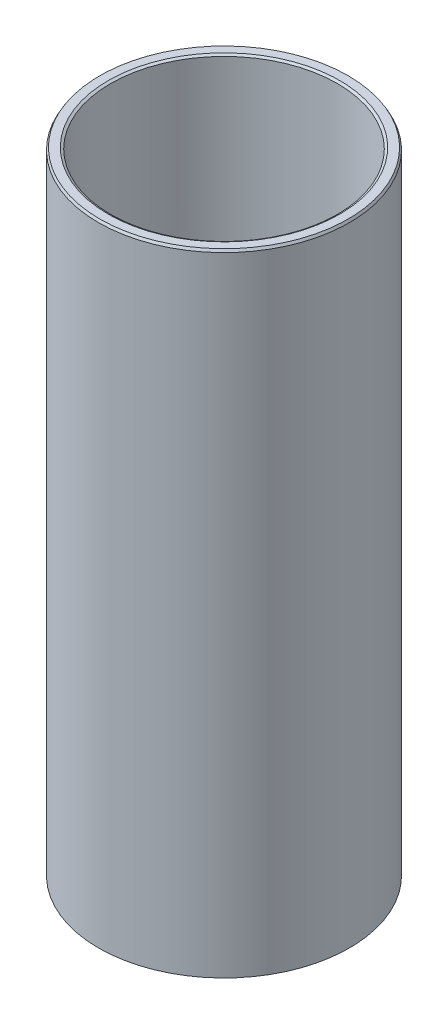
ISO-10303-21;
HEADER;
FILE_DESCRIPTION(('STEP AP214'),'2;1');
FILE_NAME('part.step','',(''),(''),'','','');
FILE_SCHEMA(('AUTOMOTIVE_DESIGN { 1 0 10303 214 1 1 1 1 }'));
ENDSEC;
DATA;
#1=APPLICATION_CONTEXT('core data for automotive mechanical design processes');
#2=APPLICATION_PROTOCOL_DEFINITION('international standard','automotive_design',2000,#1);
#3=PRODUCT_CONTEXT('',#1,'mechanical');
#4=PRODUCT('Part','Part','',(#3));
#5=PRODUCT_RELATED_PRODUCT_CATEGORY('part','',(#4));
#6=PRODUCT_DEFINITION_FORMATION('','',#4);
#7=PRODUCT_DEFINITION_CONTEXT('part definition',#1,'design');
#8=PRODUCT_DEFINITION('design','',#6,#7);
#9=PRODUCT_DEFINITION_SHAPE('','',#8);
#10=(LENGTH_UNIT() NAMED_UNIT(*) SI_UNIT(.MILLI.,.METRE.));
#11=(NAMED_UNIT(*) PLANE_ANGLE_UNIT() SI_UNIT($,.RADIAN.));
#12=(NAMED_UNIT(*) SI_UNIT($,.STERADIAN.) SOLID_ANGLE_UNIT());
#13=UNCERTAINTY_MEASURE_WITH_UNIT(LENGTH_MEASURE(1.E-05),#10,'distance_accuracy_value','');
#14=(GEOMETRIC_REPRESENTATION_CONTEXT(3) GLOBAL_UNCERTAINTY_ASSIGNED_CONTEXT((#13)) GLOBAL_UNIT_ASSIGNED_CONTEXT((#10,
#11,#12)) REPRESENTATION_CONTEXT('',''));
#15=CARTESIAN_POINT('',(0.,0.,0.));
#16=DIRECTION('',(0.,0.,1.));
#17=DIRECTION('',(1.,0.,0.));
#18=AXIS2_PLACEMENT_3D('',#15,#16,#17);
#19=CARTESIAN_POINT('',(0.,276.860027287661,0.));
#20=DIRECTION('',(0.,-1.,0.));
#21=DIRECTION('',(0.,0.,-1.));
#22=AXIS2_PLACEMENT_3D('',#19,#20,#21);
#23=CYLINDRICAL_SURFACE('',#22,55.);
#24=CARTESIAN_POINT('',(0.,0.606831183895817,0.));
#25=DIRECTION('',(0.,1.,0.));
#26=DIRECTION('',(0.,0.,1.));
#27=AXIS2_PLACEMENT_3D('',#24,#25,#26);
#28=CIRCLE('',#27,55.);
#29=CARTESIAN_POINT('',(0.,0.606831183895762,-55.));
#30=VERTEX_POINT('',#29);
#31=EDGE_CURVE('E10',#30,#30,#28,.T.);
#32=CARTESIAN_POINT('',(0.,275.808964845537,0.));
#33=DIRECTION('',(0.,1.,0.));
#34=DIRECTION('',(0.,0.,1.));
#35=AXIS2_PLACEMENT_3D('',#32,#33,#34);
#36=CIRCLE('',#35,55.);
#37=CARTESIAN_POINT('',(0.,275.808964845537,-55.));
#38=VERTEX_POINT('',#37);
#39=EDGE_CURVE('E50',#38,#38,#36,.F.);
#40=CARTESIAN_POINT('',(0.,0.606831183895762,-55.));
#41=CARTESIAN_POINT('',(0.,3.47352007620453,-55.));
#42=CARTESIAN_POINT('',(0.,6.3402089685133,-55.));
#43=CARTESIAN_POINT('',(0.,12.0735867531308,-55.));
#44=CARTESIAN_POINT('',(0.,14.9402756454396,-55.));
#45=CARTESIAN_POINT('',(0.,20.6736534300571,-55.));
#46=CARTESIAN_POINT('',(0.,23.5403423223659,-55.));
#47=CARTESIAN_POINT('',(0.,29.2737201069834,-55.));
#48=CARTESIAN_POINT('',(0.,32.1404089992921,-55.));
#49=CARTESIAN_POINT('',(0.,37.8737867839097,-55.));
#50=CARTESIAN_POINT('',(0.,40.7404756762184,-55.));
#51=CARTESIAN_POINT('',(0.,46.4738534608359,-55.));
#52=CARTESIAN_POINT('',(0.,49.3405423531447,-55.));
#53=CARTESIAN_POINT('',(0.,55.0739201377622,-55.));
#54=CARTESIAN_POINT('',(0.,57.940609030071,-55.));
#55=CARTESIAN_POINT('',(0.,63.6739868146885,-55.));
#56=CARTESIAN_POINT('',(0.,66.5406757069973,-55.));
#57=CARTESIAN_POINT('',(0.,72.2740534916148,-55.));
#58=CARTESIAN_POINT('',(0.,75.1407423839236,-55.));
#59=CARTESIAN_POINT('',(0.,80.8741201685411,-55.));
#60=CARTESIAN_POINT('',(0.,83.7408090608499,-55.));
#61=CARTESIAN_POINT('',(0.,89.4741868454674,-55.));
#62=CARTESIAN_POINT('',(0.,92.3408757377762,-55.));
#63=CARTESIAN_POINT('',(0.,98.0742535223937,-55.));
#64=CARTESIAN_POINT('',(0.,100.940942414702,-55.));
#65=CARTESIAN_POINT('',(0.,106.67432019932,-55.));
#66=CARTESIAN_POINT('',(0.,109.541009091629,-55.));
#67=CARTESIAN_POINT('',(0.,115.274386876246,-55.));
#68=CARTESIAN_POINT('',(0.,118.141075768555,-55.));
#69=CARTESIAN_POINT('',(0.,123.874453553173,-55.));
#70=CARTESIAN_POINT('',(0.,126.741142445481,-55.));
#71=CARTESIAN_POINT('',(0.,132.474520230099,-55.));
#72=CARTESIAN_POINT('',(0.,135.341209122408,-55.));
#73=CARTESIAN_POINT('',(0.,141.074586907025,-55.));
#74=CARTESIAN_POINT('',(0.,143.941275799334,-55.));
#75=CARTESIAN_POINT('',(0.,149.674653583951,-55.));
#76=CARTESIAN_POINT('',(0.,152.54134247626,-55.));
#77=CARTESIAN_POINT('',(0.,158.274720260878,-55.));
#78=CARTESIAN_POINT('',(0.,161.141409153187,-55.));
#79=CARTESIAN_POINT('',(0.,166.874786937804,-55.));
#80=CARTESIAN_POINT('',(0.,169.741475830113,-55.));
#81=CARTESIAN_POINT('',(0.,175.47485361473,-55.));
#82=CARTESIAN_POINT('',(0.,178.341542507039,-55.));
#83=CARTESIAN_POINT('',(0.,184.074920291657,-55.));
#84=CARTESIAN_POINT('',(0.,186.941609183965,-55.));
#85=CARTESIAN_POINT('',(0.,192.674986968583,-55.));
#86=CARTESIAN_POINT('',(0.,195.541675860892,-55.));
#87=CARTESIAN_POINT('',(0.,201.275053645509,-55.));
#88=CARTESIAN_POINT('',(0.,204.141742537818,-55.));
#89=CARTESIAN_POINT('',(0.,209.875120322435,-55.));
#90=CARTESIAN_POINT('',(0.,212.741809214744,-55.));
#91=CARTESIAN_POINT('',(0.,218.475186999362,-55.));
#92=CARTESIAN_POINT('',(0.,221.34187589167,-55.));
#93=CARTESIAN_POINT('',(0.,227.075253676288,-55.));
#94=CARTESIAN_POINT('',(0.,229.941942568597,-55.));
#95=CARTESIAN_POINT('',(0.,235.675320353214,-55.));
#96=CARTESIAN_POINT('',(0.,238.542009245523,-55.));
#97=CARTESIAN_POINT('',(0.,244.275387030141,-55.));
#98=CARTESIAN_POINT('',(0.,247.142075922449,-55.));
#99=CARTESIAN_POINT('',(0.,252.875453707067,-55.));
#100=CARTESIAN_POINT('',(0.,255.742142599376,-55.));
#101=CARTESIAN_POINT('',(0.,261.475520383993,-55.));
#102=CARTESIAN_POINT('',(0.,264.342209276302,-55.));
#103=CARTESIAN_POINT('',(0.,270.075587060919,-55.));
#104=CARTESIAN_POINT('',(0.,272.942275953228,-55.));
#105=CARTESIAN_POINT('',(0.,275.808964845537,-55.));
#106=B_SPLINE_CURVE_WITH_KNOTS('',3,(#40,#41,#42,#43,#44,#45,#46,#47,#48,#49,#50,#51,#52,#53,
#54,#55,#56,#57,#58,#59,#60,#61,#62,#63,#64,#65,#66,#67,#68,#69,#70,#71,#72,#73,#74,#75,#76,#77,
#78,#79,#80,#81,#82,#83,#84,#85,#86,#87,#88,#89,#90,#91,#92,#93,#94,#95,#96,#97,#98,#99,#100,
#101,#102,#103,#104,#105),.UNSPECIFIED.,.F.,.F.,(4,2,2,2,2,2,2,2,2,2,2,2,2,2,2,2,2,2,2,2,2,2,2,
2,2,2,2,2,2,2,2,2,4),(0.,8.60006667692631,17.2001333538526,25.8002000307789,34.4002667077051,
43.0003333846314,51.6004000615577,60.200466738484,68.8005334154103,77.4006000923366,
86.0006667692629,94.6007334461892,103.200800123115,111.800866800042,120.400933476968,
129.001000153894,137.601066830821,146.201133507747,154.801200184673,163.4012668616,
172.001333538526,180.601400215452,189.201466892378,197.801533569305,206.401600246231,
215.001666923157,223.601733600084,232.20180027701,240.801866953936,249.401933630862,
258.002000307789,266.602066984715,275.202133661641),.UNSPECIFIED.);
#107=EDGE_CURVE('BSEAM39',#30,#38,#106,.T.);
#108=ORIENTED_EDGE('',*,*,#31,.T.);
#109=ORIENTED_EDGE('',*,*,#39,.T.);
#110=ORIENTED_EDGE('',*,*,#107,.T.);
#111=ORIENTED_EDGE('',*,*,#107,.F.);
#112=EDGE_LOOP('',(#108,#110,#109,#111));
#113=FACE_BOUND('',#112,.T.);
#114=ADVANCED_FACE('F39',(#113),#23,.T.);
#115=CARTESIAN_POINT('',(0.,276.860027287661,0.));
#116=DIRECTION('',(0.,1.,0.));
#117=DIRECTION('',(0.,0.,1.));
#118=AXIS2_PLACEMENT_3D('',#115,#116,#117);
#119=PLANE('',#118);
#120=CARTESIAN_POINT('',(0.,276.860027287661,0.));
#121=DIRECTION('',(0.,1.,0.));
#122=DIRECTION('',(0.,0.,1.));
#123=AXIS2_PLACEMENT_3D('',#120,#121,#122);
#124=CIRCLE('',#123,50.7158337583343);
#125=CARTESIAN_POINT('',(0.,276.860027287661,50.7158337583343));
#126=VERTEX_POINT('',#125);
#127=EDGE_CURVE('E58',#126,#126,#124,.F.);
#128=ORIENTED_EDGE('',*,*,#127,.T.);
#129=EDGE_LOOP('',(#128));
#130=FACE_BOUND('',#129,.T.);
#131=CARTESIAN_POINT('',(0.,276.860027287661,0.));
#132=DIRECTION('',(0.,1.,0.));
#133=DIRECTION('',(0.,0.,1.));
#134=AXIS2_PLACEMENT_3D('',#131,#132,#133);
#135=CIRCLE('',#134,54.3931688161045);
#136=CARTESIAN_POINT('',(0.,276.860027287661,54.3931688161045));
#137=VERTEX_POINT('',#136);
#138=EDGE_CURVE('E61',#137,#137,#135,.T.);
#139=ORIENTED_EDGE('',*,*,#138,.T.);
#140=EDGE_LOOP('',(#139));
#141=FACE_BOUND('',#140,.T.);
#142=ADVANCED_FACE('F88',(#130,#141),#119,.T.);
#143=CARTESIAN_POINT('',(0.,0.,0.));
#144=DIRECTION('',(0.,1.,0.));
#145=DIRECTION('',(0.,0.,1.));
#146=AXIS2_PLACEMENT_3D('',#143,#144,#145);
#147=PLANE('',#146);
#148=CARTESIAN_POINT('',(0.,0.,0.));
#149=DIRECTION('',(0.,1.,0.));
#150=DIRECTION('',(0.,0.,1.));
#151=AXIS2_PLACEMENT_3D('',#148,#149,#150);
#152=CIRCLE('',#151,50.2716025001053);
#153=CARTESIAN_POINT('',(0.,0.,50.2716025001053));
#154=VERTEX_POINT('',#153);
#155=EDGE_CURVE('E51',#154,#154,#152,.T.);
#156=ORIENTED_EDGE('',*,*,#155,.T.);
#157=EDGE_LOOP('',(#156));
#158=FACE_BOUND('',#157,.T.);
#159=CARTESIAN_POINT('',(0.,0.,0.));
#160=DIRECTION('',(0.,1.,0.));
#161=DIRECTION('',(0.,0.,1.));
#162=AXIS2_PLACEMENT_3D('',#159,#160,#161);
#163=CIRCLE('',#162,53.9489375578753);
#164=CARTESIAN_POINT('',(0.,0.,53.9489375578753));
#165=VERTEX_POINT('',#164);
#166=EDGE_CURVE('E54',#165,#165,#163,.F.);
#167=ORIENTED_EDGE('',*,*,#166,.T.);
#168=EDGE_LOOP('',(#167));
#169=FACE_BOUND('',#168,.T.);
#170=ADVANCED_FACE('F83',(#158,#169),#147,.F.);
#171=CARTESIAN_POINT('',(0.,276.860027287661,0.));
#172=DIRECTION('',(0.,-1.,0.));
#173=DIRECTION('',(0.,0.,-1.));
#174=AXIS2_PLACEMENT_3D('',#171,#172,#173);
#175=CYLINDRICAL_SURFACE('',#174,49.6647713162096);
#176=CARTESIAN_POINT('',(0.,276.253196103765,0.));
#177=DIRECTION('',(0.,1.,0.));
#178=DIRECTION('',(0.,0.,1.));
#179=AXIS2_PLACEMENT_3D('',#176,#177,#178);
#180=CIRCLE('',#179,49.6647713162096);
#181=CARTESIAN_POINT('',(0.,276.253196103765,-49.6647713162096));
#182=VERTEX_POINT('',#181);
#183=EDGE_CURVE('E67',#182,#182,#180,.T.);
#184=CARTESIAN_POINT('',(0.,1.0510624421245,0.));
#185=DIRECTION('',(0.,1.,0.));
#186=DIRECTION('',(0.,0.,1.));
#187=AXIS2_PLACEMENT_3D('',#184,#185,#186);
#188=CIRCLE('',#187,49.6647713162096);
#189=CARTESIAN_POINT('',(0.,1.05106244212444,-49.6647713162096));
#190=VERTEX_POINT('',#189);
#191=EDGE_CURVE('E69',#190,#190,#188,.F.);
#192=CARTESIAN_POINT('',(0.,276.253196103765,-49.6647713162096));
#193=CARTESIAN_POINT('',(0.,273.386507211457,-49.6647713162096));
#194=CARTESIAN_POINT('',(0.,270.519818319148,-49.6647713162096));
#195=CARTESIAN_POINT('',(0.,264.78644053453,-49.6647713162096));
#196=CARTESIAN_POINT('',(0.,261.919751642222,-49.6647713162096));
#197=CARTESIAN_POINT('',(0.,256.186373857604,-49.6647713162096));
#198=CARTESIAN_POINT('',(0.,253.319684965295,-49.6647713162096));
#199=CARTESIAN_POINT('',(0.,247.586307180678,-49.6647713162096));
#200=CARTESIAN_POINT('',(0.,244.719618288369,-49.6647713162096));
#201=CARTESIAN_POINT('',(0.,238.986240503752,-49.6647713162096));
#202=CARTESIAN_POINT('',(0.,236.119551611443,-49.6647713162096));
#203=CARTESIAN_POINT('',(0.,230.386173826825,-49.6647713162096));
#204=CARTESIAN_POINT('',(0.,227.519484934516,-49.6647713162096));
#205=CARTESIAN_POINT('',(0.,221.786107149899,-49.6647713162096));
#206=CARTESIAN_POINT('',(0.,218.91941825759,-49.6647713162096));
#207=CARTESIAN_POINT('',(0.,213.186040472973,-49.6647713162096));
#208=CARTESIAN_POINT('',(0.,210.319351580664,-49.6647713162096));
#209=CARTESIAN_POINT('',(0.,204.585973796046,-49.6647713162096));
#210=CARTESIAN_POINT('',(0.,201.719284903738,-49.6647713162096));
#211=CARTESIAN_POINT('',(0.,195.98590711912,-49.6647713162096));
#212=CARTESIAN_POINT('',(0.,193.119218226811,-49.6647713162096));
#213=CARTESIAN_POINT('',(0.,187.385840442194,-49.6647713162096));
#214=CARTESIAN_POINT('',(0.,184.519151549885,-49.6647713162096));
#215=CARTESIAN_POINT('',(0.,178.785773765268,-49.6647713162096));
#216=CARTESIAN_POINT('',(0.,175.919084872959,-49.6647713162096));
#217=CARTESIAN_POINT('',(0.,170.185707088341,-49.6647713162096));
#218=CARTESIAN_POINT('',(0.,167.319018196033,-49.6647713162096));
#219=CARTESIAN_POINT('',(0.,161.585640411415,-49.6647713162096));
#220=CARTESIAN_POINT('',(0.,158.718951519106,-49.6647713162096));
#221=CARTESIAN_POINT('',(0.,152.985573734489,-49.6647713162096));
#222=CARTESIAN_POINT('',(0.,150.11888484218,-49.6647713162096));
#223=CARTESIAN_POINT('',(0.,144.385507057562,-49.6647713162096));
#224=CARTESIAN_POINT('',(0.,141.518818165254,-49.6647713162096));
#225=CARTESIAN_POINT('',(0.,135.785440380636,-49.6647713162096));
#226=CARTESIAN_POINT('',(0.,132.918751488327,-49.6647713162096));
#227=CARTESIAN_POINT('',(0.,127.18537370371,-49.6647713162096));
#228=CARTESIAN_POINT('',(0.,124.318684811401,-49.6647713162096));
#229=CARTESIAN_POINT('',(0.,118.585307026784,-49.6647713162096));
#230=CARTESIAN_POINT('',(0.,115.718618134475,-49.6647713162096));
#231=CARTESIAN_POINT('',(0.,109.985240349857,-49.6647713162096));
#232=CARTESIAN_POINT('',(0.,107.118551457549,-49.6647713162096));
#233=CARTESIAN_POINT('',(0.,101.385173672931,-49.6647713162096));
#234=CARTESIAN_POINT('',(0.,98.5184847806223,-49.6647713162096));
#235=CARTESIAN_POINT('',(0.,92.7851069960048,-49.6647713162096));
#236=CARTESIAN_POINT('',(0.,89.918418103696,-49.6647713162096));
#237=CARTESIAN_POINT('',(0.,84.1850403190785,-49.6647713162096));
#238=CARTESIAN_POINT('',(0.,81.3183514267697,-49.6647713162096));
#239=CARTESIAN_POINT('',(0.,75.5849736421522,-49.6647713162096));
#240=CARTESIAN_POINT('',(0.,72.7182847498434,-49.6647713162096));
#241=CARTESIAN_POINT('',(0.,66.9849069652259,-49.6647713162096));
#242=CARTESIAN_POINT('',(0.,64.1182180729172,-49.6647713162096));
#243=CARTESIAN_POINT('',(0.,58.3848402882997,-49.6647713162096));
#244=CARTESIAN_POINT('',(0.,55.5181513959909,-49.6647713162096));
#245=CARTESIAN_POINT('',(0.,49.7847736113734,-49.6647713162096));
#246=CARTESIAN_POINT('',(0.,46.9180847190646,-49.6647713162096));
#247=CARTESIAN_POINT('',(0.,41.1847069344471,-49.6647713162096));
#248=CARTESIAN_POINT('',(0.,38.3180180421383,-49.6647713162096));
#249=CARTESIAN_POINT('',(0.,32.5846402575208,-49.6647713162096));
#250=CARTESIAN_POINT('',(0.,29.7179513652121,-49.6647713162096));
#251=CARTESIAN_POINT('',(0.,23.9845735805945,-49.6647713162096));
#252=CARTESIAN_POINT('',(0.,21.1178846882858,-49.6647713162096));
#253=CARTESIAN_POINT('',(0.,15.3845069036682,-49.6647713162096));
#254=CARTESIAN_POINT('',(0.,12.5178180113595,-49.6647713162096));
#255=CARTESIAN_POINT('',(0.,6.78444022674194,-49.6647713162096));
#256=CARTESIAN_POINT('',(0.,3.91775133443319,-49.6647713162096));
#257=CARTESIAN_POINT('',(0.,1.05106244212444,-49.6647713162096));
#258=B_SPLINE_CURVE_WITH_KNOTS('',3,(#192,#193,#194,#195,#196,#197,#198,#199,#200,#201,#202,
#203,#204,#205,#206,#207,#208,#209,#210,#211,#212,#213,#214,#215,#216,#217,#218,#219,#220,#221,
#222,#223,#224,#225,#226,#227,#228,#229,#230,#231,#232,#233,#234,#235,#236,#237,#238,#239,#240,
#241,#242,#243,#244,#245,#246,#247,#248,#249,#250,#251,#252,#253,#254,#255,#256,#257),
.UNSPECIFIED.,.F.,.F.,(4,2,2,2,2,2,2,2,2,2,2,2,2,2,2,2,2,2,2,2,2,2,2,2,2,2,2,2,2,2,2,2,4),(0.,
8.60006667692625,17.2001333538525,25.8002000307788,34.4002667077051,43.0003333846314,
51.6004000615576,60.2004667384839,68.8005334154102,77.4006000923365,86.0006667692628,
94.6007334461891,103.200800123115,111.800866800042,120.400933476968,129.001000153894,
137.60106683082,146.201133507747,154.801200184673,163.401266861599,172.001333538526,
180.601400215452,189.201466892378,197.801533569304,206.401600246231,215.001666923157,
223.601733600083,232.20180027701,240.801866953936,249.401933630862,258.002000307788,
266.602066984715,275.202133661641),.UNSPECIFIED.);
#259=EDGE_CURVE('BSEAM71',#182,#190,#258,.T.);
#260=ORIENTED_EDGE('',*,*,#183,.T.);
#261=ORIENTED_EDGE('',*,*,#191,.T.);
#262=ORIENTED_EDGE('',*,*,#259,.T.);
#263=ORIENTED_EDGE('',*,*,#259,.F.);
#264=EDGE_LOOP('',(#260,#262,#261,#263));
#265=FACE_BOUND('',#264,.T.);
#266=ADVANCED_FACE('F71',(#265),#175,.F.);
#267=CARTESIAN_POINT('',(0.,276.253196103765,0.));
#268=DIRECTION('',(0.,1.,0.));
#269=DIRECTION('',(0.,0.,1.));
#270=AXIS2_PLACEMENT_3D('',#267,#268,#269);
#271=CONICAL_SURFACE('',#270,49.6647713162096,1.0471975511966);
#272=ORIENTED_EDGE('',*,*,#127,.F.);
#273=EDGE_LOOP('',(#272));
#274=FACE_BOUND('',#273,.T.);
#275=ORIENTED_EDGE('',*,*,#183,.F.);
#276=EDGE_LOOP('',(#275));
#277=FACE_BOUND('',#276,.T.);
#278=ADVANCED_FACE('F77',(#274,#277),#271,.F.);
#279=CARTESIAN_POINT('',(0.,0.,0.));
#280=DIRECTION('',(0.,-1.,0.));
#281=DIRECTION('',(0.,0.,-1.));
#282=AXIS2_PLACEMENT_3D('',#279,#280,#281);
#283=CONICAL_SURFACE('',#282,50.2716025001053,0.523598775598316);
#284=ORIENTED_EDGE('',*,*,#191,.F.);
#285=EDGE_LOOP('',(#284));
#286=FACE_BOUND('',#285,.T.);
#287=ORIENTED_EDGE('',*,*,#155,.F.);
#288=EDGE_LOOP('',(#287));
#289=FACE_BOUND('',#288,.T.);
#290=ADVANCED_FACE('F73',(#286,#289),#283,.F.);
#291=CARTESIAN_POINT('',(0.,0.606831183895817,0.));
#292=DIRECTION('',(0.,1.,0.));
#293=DIRECTION('',(0.,0.,1.));
#294=AXIS2_PLACEMENT_3D('',#291,#292,#293);
#295=CONICAL_SURFACE('',#294,55.,1.04719755119658);
#296=ORIENTED_EDGE('',*,*,#166,.F.);
#297=EDGE_LOOP('',(#296));
#298=FACE_BOUND('',#297,.T.);
#299=ORIENTED_EDGE('',*,*,#31,.F.);
#300=EDGE_LOOP('',(#299));
#301=FACE_BOUND('',#300,.T.);
#302=ADVANCED_FACE('F76',(#298,#301),#295,.T.);
#303=CARTESIAN_POINT('',(0.,276.860027287661,0.));
#304=DIRECTION('',(0.,-1.,0.));
#305=DIRECTION('',(0.,0.,-1.));
#306=AXIS2_PLACEMENT_3D('',#303,#304,#305);
#307=CONICAL_SURFACE('',#306,54.3931688161045,0.523598775598319);
#308=ORIENTED_EDGE('',*,*,#39,.F.);
#309=EDGE_LOOP('',(#308));
#310=FACE_BOUND('',#309,.T.);
#311=ORIENTED_EDGE('',*,*,#138,.F.);
#312=EDGE_LOOP('',(#311));
#313=FACE_BOUND('',#312,.T.);
#314=ADVANCED_FACE('F45',(#310,#313),#307,.T.);
#315=CLOSED_SHELL('',(#114,#142,#170,#266,#278,#290,#302,#314));
#316=MANIFOLD_SOLID_BREP('B2',#315);
#317=ADVANCED_BREP_SHAPE_REPRESENTATION('',(#18,#316),#14);
#318=SHAPE_DEFINITION_REPRESENTATION(#9,#317);
ENDSEC;
END-ISO-10303-21;
